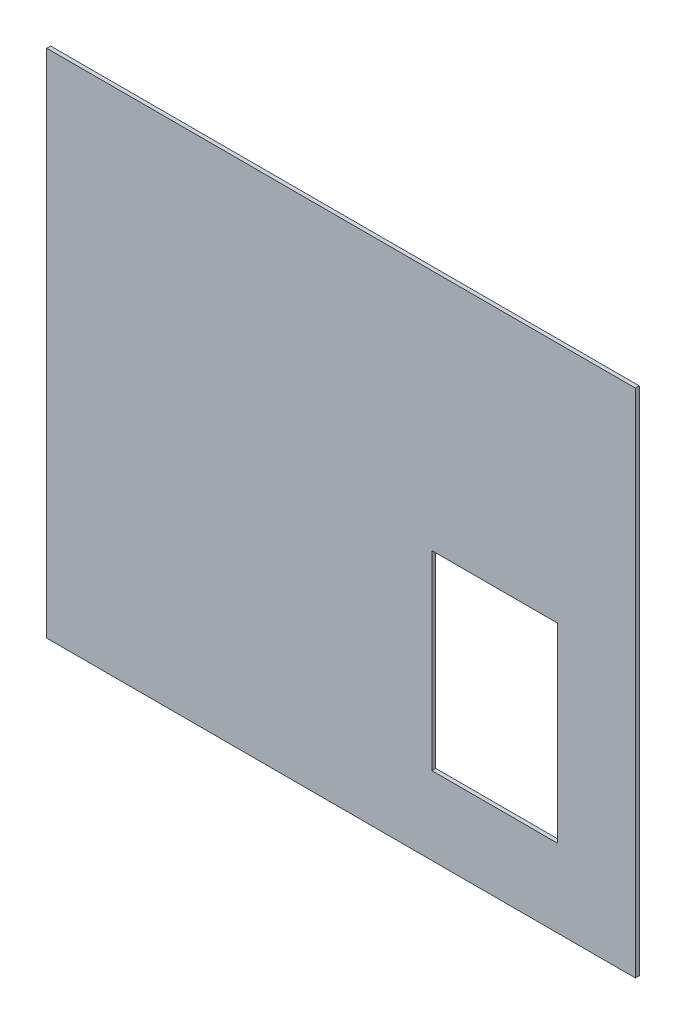
ISO-10303-21;
HEADER;
FILE_DESCRIPTION(('STEP AP214'),'2;1');
FILE_NAME('part.step','',(''),(''),'','','');
FILE_SCHEMA(('AUTOMOTIVE_DESIGN { 1 0 10303 214 1 1 1 1 }'));
ENDSEC;
DATA;
#1=APPLICATION_CONTEXT('core data for automotive mechanical design processes');
#2=APPLICATION_PROTOCOL_DEFINITION('international standard','automotive_design',2000,#1);
#3=PRODUCT_CONTEXT('',#1,'mechanical');
#4=PRODUCT('Part','Part','',(#3));
#5=PRODUCT_RELATED_PRODUCT_CATEGORY('part','',(#4));
#6=PRODUCT_DEFINITION_FORMATION('','',#4);
#7=PRODUCT_DEFINITION_CONTEXT('part definition',#1,'design');
#8=PRODUCT_DEFINITION('design','',#6,#7);
#9=PRODUCT_DEFINITION_SHAPE('','',#8);
#10=(LENGTH_UNIT() NAMED_UNIT(*) SI_UNIT(.MILLI.,.METRE.));
#11=(NAMED_UNIT(*) PLANE_ANGLE_UNIT() SI_UNIT($,.RADIAN.));
#12=(NAMED_UNIT(*) SI_UNIT($,.STERADIAN.) SOLID_ANGLE_UNIT());
#13=UNCERTAINTY_MEASURE_WITH_UNIT(LENGTH_MEASURE(1.E-05),#10,'distance_accuracy_value','');
#14=(GEOMETRIC_REPRESENTATION_CONTEXT(3) GLOBAL_UNCERTAINTY_ASSIGNED_CONTEXT((#13)) GLOBAL_UNIT_ASSIGNED_CONTEXT((#10,
#11,#12)) REPRESENTATION_CONTEXT('',''));
#15=CARTESIAN_POINT('',(0.,0.,0.));
#16=DIRECTION('',(0.,0.,1.));
#17=DIRECTION('',(1.,0.,0.));
#18=AXIS2_PLACEMENT_3D('',#15,#16,#17);
#19=CARTESIAN_POINT('',(227.,197.,0.));
#20=DIRECTION('',(0.,0.,1.));
#21=DIRECTION('',(1.,0.,0.));
#22=AXIS2_PLACEMENT_3D('',#19,#20,#21);
#23=PLANE('',#22);
#24=DIRECTION('',(1.,0.,0.));
#25=VECTOR('',#24,1.);
#26=CARTESIAN_POINT('',(297.,60.,0.));
#27=LINE('',#26,#25);
#28=CARTESIAN_POINT('',(297.,60.,0.));
#29=VERTEX_POINT('',#28);
#30=CARTESIAN_POINT('',(394.,60.,0.));
#31=VERTEX_POINT('',#30);
#32=EDGE_CURVE('E129',#29,#31,#27,.T.);
#33=ORIENTED_EDGE('',*,*,#32,.T.);
#34=DIRECTION('',(0.,1.,0.));
#35=VECTOR('',#34,1.);
#36=CARTESIAN_POINT('',(394.,60.,0.));
#37=LINE('',#36,#35);
#38=CARTESIAN_POINT('',(394.,207.,0.));
#39=VERTEX_POINT('',#38);
#40=EDGE_CURVE('E119',#31,#39,#37,.T.);
#41=ORIENTED_EDGE('',*,*,#40,.T.);
#42=DIRECTION('',(1.,0.,0.));
#43=VECTOR('',#42,1.);
#44=CARTESIAN_POINT('',(394.,207.,0.));
#45=LINE('',#44,#43);
#46=CARTESIAN_POINT('',(297.,207.,0.));
#47=VERTEX_POINT('',#46);
#48=EDGE_CURVE('E114',#39,#47,#45,.F.);
#49=ORIENTED_EDGE('',*,*,#48,.T.);
#50=DIRECTION('',(0.,-1.,0.));
#51=VECTOR('',#50,1.);
#52=CARTESIAN_POINT('',(297.,207.,0.));
#53=LINE('',#52,#51);
#54=EDGE_CURVE('E112',#47,#29,#53,.T.);
#55=ORIENTED_EDGE('',*,*,#54,.T.);
#56=EDGE_LOOP('',(#33,#41,#49,#55));
#57=FACE_BOUND('',#56,.T.);
#58=DIRECTION('',(0.,1.,0.));
#59=VECTOR('',#58,1.);
#60=CARTESIAN_POINT('',(0.,394.,0.));
#61=LINE('',#60,#59);
#62=CARTESIAN_POINT('',(0.,394.,0.));
#63=VERTEX_POINT('',#62);
#64=CARTESIAN_POINT('',(0.,0.,0.));
#65=VERTEX_POINT('',#64);
#66=EDGE_CURVE('E106',#63,#65,#61,.F.);
#67=ORIENTED_EDGE('',*,*,#66,.F.);
#68=DIRECTION('',(1.,0.,0.));
#69=VECTOR('',#68,1.);
#70=CARTESIAN_POINT('',(454.,394.,0.));
#71=LINE('',#70,#69);
#72=CARTESIAN_POINT('',(454.,394.,0.));
#73=VERTEX_POINT('',#72);
#74=EDGE_CURVE('E82',#73,#63,#71,.F.);
#75=ORIENTED_EDGE('',*,*,#74,.F.);
#76=DIRECTION('',(0.,1.,0.));
#77=VECTOR('',#76,1.);
#78=CARTESIAN_POINT('',(454.,0.,0.));
#79=LINE('',#78,#77);
#80=CARTESIAN_POINT('',(454.,0.,0.));
#81=VERTEX_POINT('',#80);
#82=EDGE_CURVE('E84',#81,#73,#79,.T.);
#83=ORIENTED_EDGE('',*,*,#82,.F.);
#84=DIRECTION('',(1.,0.,0.));
#85=VECTOR('',#84,1.);
#86=CARTESIAN_POINT('',(0.,0.,0.));
#87=LINE('',#86,#85);
#88=EDGE_CURVE('E22',#65,#81,#87,.T.);
#89=ORIENTED_EDGE('',*,*,#88,.F.);
#90=EDGE_LOOP('',(#67,#75,#83,#89));
#91=FACE_BOUND('',#90,.T.);
#92=ADVANCED_FACE('F19',(#57,#91),#23,.F.);
#93=CARTESIAN_POINT('',(0.,0.,0.));
#94=DIRECTION('',(0.,-1.,0.));
#95=DIRECTION('',(0.,0.,-1.));
#96=AXIS2_PLACEMENT_3D('',#93,#94,#95);
#97=PLANE('',#96);
#98=DIRECTION('',(1.,0.,0.));
#99=VECTOR('',#98,1.);
#100=CARTESIAN_POINT('',(227.,0.,3.));
#101=LINE('',#100,#99);
#102=CARTESIAN_POINT('',(0.,0.,3.));
#103=VERTEX_POINT('',#102);
#104=CARTESIAN_POINT('',(454.,0.,3.));
#105=VERTEX_POINT('',#104);
#106=EDGE_CURVE('E163',#103,#105,#101,.T.);
#107=ORIENTED_EDGE('',*,*,#106,.F.);
#108=DIRECTION('',(0.,0.,1.));
#109=VECTOR('',#108,1.);
#110=CARTESIAN_POINT('',(0.,0.,0.));
#111=LINE('',#110,#109);
#112=EDGE_CURVE('E95',#65,#103,#111,.T.);
#113=ORIENTED_EDGE('',*,*,#112,.F.);
#114=ORIENTED_EDGE('',*,*,#88,.T.);
#115=DIRECTION('',(0.,0.,-1.));
#116=VECTOR('',#115,1.);
#117=CARTESIAN_POINT('',(454.,0.,0.));
#118=LINE('',#117,#116);
#119=EDGE_CURVE('E90',#105,#81,#118,.T.);
#120=ORIENTED_EDGE('',*,*,#119,.F.);
#121=EDGE_LOOP('',(#107,#113,#114,#120));
#122=FACE_BOUND('',#121,.T.);
#123=ADVANCED_FACE('F92',(#122),#97,.T.);
#124=CARTESIAN_POINT('',(454.,0.,0.));
#125=DIRECTION('',(1.,0.,0.));
#126=DIRECTION('',(0.,0.,-1.));
#127=AXIS2_PLACEMENT_3D('',#124,#125,#126);
#128=PLANE('',#127);
#129=DIRECTION('',(0.,1.,0.));
#130=VECTOR('',#129,1.);
#131=CARTESIAN_POINT('',(454.,197.,3.));
#132=LINE('',#131,#130);
#133=CARTESIAN_POINT('',(454.,394.,3.));
#134=VERTEX_POINT('',#133);
#135=EDGE_CURVE('E99',#105,#134,#132,.T.);
#136=ORIENTED_EDGE('',*,*,#135,.F.);
#137=ORIENTED_EDGE('',*,*,#119,.T.);
#138=ORIENTED_EDGE('',*,*,#82,.T.);
#139=DIRECTION('',(0.,0.,1.));
#140=VECTOR('',#139,1.);
#141=CARTESIAN_POINT('',(454.,394.,0.));
#142=LINE('',#141,#140);
#143=EDGE_CURVE('E102',#134,#73,#142,.F.);
#144=ORIENTED_EDGE('',*,*,#143,.F.);
#145=EDGE_LOOP('',(#136,#137,#138,#144));
#146=FACE_BOUND('',#145,.T.);
#147=ADVANCED_FACE('F97',(#146),#128,.T.);
#148=CARTESIAN_POINT('',(454.,394.,0.));
#149=DIRECTION('',(0.,1.,0.));
#150=DIRECTION('',(0.,0.,1.));
#151=AXIS2_PLACEMENT_3D('',#148,#149,#150);
#152=PLANE('',#151);
#153=DIRECTION('',(1.,0.,0.));
#154=VECTOR('',#153,1.);
#155=CARTESIAN_POINT('',(227.,394.,3.));
#156=LINE('',#155,#154);
#157=CARTESIAN_POINT('',(0.,394.,3.));
#158=VERTEX_POINT('',#157);
#159=EDGE_CURVE('E159',#134,#158,#156,.F.);
#160=ORIENTED_EDGE('',*,*,#159,.F.);
#161=ORIENTED_EDGE('',*,*,#143,.T.);
#162=ORIENTED_EDGE('',*,*,#74,.T.);
#163=DIRECTION('',(0.,0.,1.));
#164=VECTOR('',#163,1.);
#165=CARTESIAN_POINT('',(0.,394.,0.));
#166=LINE('',#165,#164);
#167=EDGE_CURVE('E109',#158,#63,#166,.F.);
#168=ORIENTED_EDGE('',*,*,#167,.F.);
#169=EDGE_LOOP('',(#160,#161,#162,#168));
#170=FACE_BOUND('',#169,.T.);
#171=ADVANCED_FACE('F171',(#170),#152,.T.);
#172=CARTESIAN_POINT('',(0.,394.,0.));
#173=DIRECTION('',(-1.,0.,0.));
#174=DIRECTION('',(0.,0.,1.));
#175=AXIS2_PLACEMENT_3D('',#172,#173,#174);
#176=PLANE('',#175);
#177=DIRECTION('',(0.,1.,0.));
#178=VECTOR('',#177,1.);
#179=CARTESIAN_POINT('',(0.,197.,3.));
#180=LINE('',#179,#178);
#181=EDGE_CURVE('E154',#158,#103,#180,.F.);
#182=ORIENTED_EDGE('',*,*,#181,.F.);
#183=ORIENTED_EDGE('',*,*,#167,.T.);
#184=ORIENTED_EDGE('',*,*,#66,.T.);
#185=ORIENTED_EDGE('',*,*,#112,.T.);
#186=EDGE_LOOP('',(#182,#183,#184,#185));
#187=FACE_BOUND('',#186,.T.);
#188=ADVANCED_FACE('F168',(#187),#176,.T.);
#189=CARTESIAN_POINT('',(297.,207.,0.));
#190=DIRECTION('',(-1.,0.,0.));
#191=DIRECTION('',(0.,-1.,0.));
#192=AXIS2_PLACEMENT_3D('',#189,#190,#191);
#193=PLANE('',#192);
#194=DIRECTION('',(0.,0.,-1.));
#195=VECTOR('',#194,1.);
#196=CARTESIAN_POINT('',(297.,60.,0.));
#197=LINE('',#196,#195);
#198=CARTESIAN_POINT('',(297.,60.,3.));
#199=VERTEX_POINT('',#198);
#200=EDGE_CURVE('E125',#199,#29,#197,.T.);
#201=ORIENTED_EDGE('',*,*,#200,.T.);
#202=ORIENTED_EDGE('',*,*,#54,.F.);
#203=DIRECTION('',(0.,0.,1.));
#204=VECTOR('',#203,1.);
#205=CARTESIAN_POINT('',(297.,207.,0.));
#206=LINE('',#205,#204);
#207=CARTESIAN_POINT('',(297.,207.,3.));
#208=VERTEX_POINT('',#207);
#209=EDGE_CURVE('E116',#47,#208,#206,.T.);
#210=ORIENTED_EDGE('',*,*,#209,.T.);
#211=DIRECTION('',(0.,1.,0.));
#212=VECTOR('',#211,1.);
#213=CARTESIAN_POINT('',(297.,197.,3.));
#214=LINE('',#213,#212);
#215=EDGE_CURVE('E152',#199,#208,#214,.T.);
#216=ORIENTED_EDGE('',*,*,#215,.F.);
#217=EDGE_LOOP('',(#201,#202,#210,#216));
#218=FACE_BOUND('',#217,.T.);
#219=ADVANCED_FACE('F179',(#218),#193,.F.);
#220=CARTESIAN_POINT('',(394.,207.,0.));
#221=DIRECTION('',(0.,1.,0.));
#222=DIRECTION('',(0.,0.,1.));
#223=AXIS2_PLACEMENT_3D('',#220,#221,#222);
#224=PLANE('',#223);
#225=ORIENTED_EDGE('',*,*,#209,.F.);
#226=ORIENTED_EDGE('',*,*,#48,.F.);
#227=DIRECTION('',(0.,0.,1.));
#228=VECTOR('',#227,1.);
#229=CARTESIAN_POINT('',(394.,207.,0.));
#230=LINE('',#229,#228);
#231=CARTESIAN_POINT('',(394.,207.,3.));
#232=VERTEX_POINT('',#231);
#233=EDGE_CURVE('E130',#39,#232,#230,.T.);
#234=ORIENTED_EDGE('',*,*,#233,.T.);
#235=DIRECTION('',(1.,0.,0.));
#236=VECTOR('',#235,1.);
#237=CARTESIAN_POINT('',(227.,207.,3.));
#238=LINE('',#237,#236);
#239=EDGE_CURVE('E147',#208,#232,#238,.T.);
#240=ORIENTED_EDGE('',*,*,#239,.F.);
#241=EDGE_LOOP('',(#225,#226,#234,#240));
#242=FACE_BOUND('',#241,.T.);
#243=ADVANCED_FACE('F142',(#242),#224,.F.);
#244=CARTESIAN_POINT('',(394.,60.,0.));
#245=DIRECTION('',(1.,0.,0.));
#246=DIRECTION('',(0.,1.,0.));
#247=AXIS2_PLACEMENT_3D('',#244,#245,#246);
#248=PLANE('',#247);
#249=ORIENTED_EDGE('',*,*,#233,.F.);
#250=ORIENTED_EDGE('',*,*,#40,.F.);
#251=DIRECTION('',(0.,0.,-1.));
#252=VECTOR('',#251,1.);
#253=CARTESIAN_POINT('',(394.,60.,0.));
#254=LINE('',#253,#252);
#255=CARTESIAN_POINT('',(394.,60.,3.));
#256=VERTEX_POINT('',#255);
#257=EDGE_CURVE('E37',#31,#256,#254,.F.);
#258=ORIENTED_EDGE('',*,*,#257,.T.);
#259=DIRECTION('',(0.,1.,0.));
#260=VECTOR('',#259,1.);
#261=CARTESIAN_POINT('',(394.,197.,3.));
#262=LINE('',#261,#260);
#263=EDGE_CURVE('E28',#232,#256,#262,.F.);
#264=ORIENTED_EDGE('',*,*,#263,.F.);
#265=EDGE_LOOP('',(#249,#250,#258,#264));
#266=FACE_BOUND('',#265,.T.);
#267=ADVANCED_FACE('F143',(#266),#248,.F.);
#268=CARTESIAN_POINT('',(297.,60.,0.));
#269=DIRECTION('',(0.,-1.,0.));
#270=DIRECTION('',(0.,0.,-1.));
#271=AXIS2_PLACEMENT_3D('',#268,#269,#270);
#272=PLANE('',#271);
#273=ORIENTED_EDGE('',*,*,#257,.F.);
#274=ORIENTED_EDGE('',*,*,#32,.F.);
#275=ORIENTED_EDGE('',*,*,#200,.F.);
#276=DIRECTION('',(1.,0.,0.));
#277=VECTOR('',#276,1.);
#278=CARTESIAN_POINT('',(227.,60.,3.));
#279=LINE('',#278,#277);
#280=EDGE_CURVE('E12',#256,#199,#279,.F.);
#281=ORIENTED_EDGE('',*,*,#280,.F.);
#282=EDGE_LOOP('',(#273,#274,#275,#281));
#283=FACE_BOUND('',#282,.T.);
#284=ADVANCED_FACE('F183',(#283),#272,.F.);
#285=CARTESIAN_POINT('',(227.,197.,3.));
#286=DIRECTION('',(0.,0.,1.));
#287=DIRECTION('',(1.,0.,0.));
#288=AXIS2_PLACEMENT_3D('',#285,#286,#287);
#289=PLANE('',#288);
#290=ORIENTED_EDGE('',*,*,#263,.T.);
#291=ORIENTED_EDGE('',*,*,#280,.T.);
#292=ORIENTED_EDGE('',*,*,#215,.T.);
#293=ORIENTED_EDGE('',*,*,#239,.T.);
#294=EDGE_LOOP('',(#290,#291,#292,#293));
#295=FACE_BOUND('',#294,.T.);
#296=ORIENTED_EDGE('',*,*,#159,.T.);
#297=ORIENTED_EDGE('',*,*,#181,.T.);
#298=ORIENTED_EDGE('',*,*,#106,.T.);
#299=ORIENTED_EDGE('',*,*,#135,.T.);
#300=EDGE_LOOP('',(#296,#297,#298,#299));
#301=FACE_BOUND('',#300,.T.);
#302=ADVANCED_FACE('F150',(#295,#301),#289,.T.);
#303=CLOSED_SHELL('',(#92,#123,#147,#171,#188,#219,#243,#267,#284,#302));
#304=MANIFOLD_SOLID_BREP('B1',#303);
#305=ADVANCED_BREP_SHAPE_REPRESENTATION('',(#18,#304),#14);
#306=SHAPE_DEFINITION_REPRESENTATION(#9,#305);
ENDSEC;
END-ISO-10303-21;
